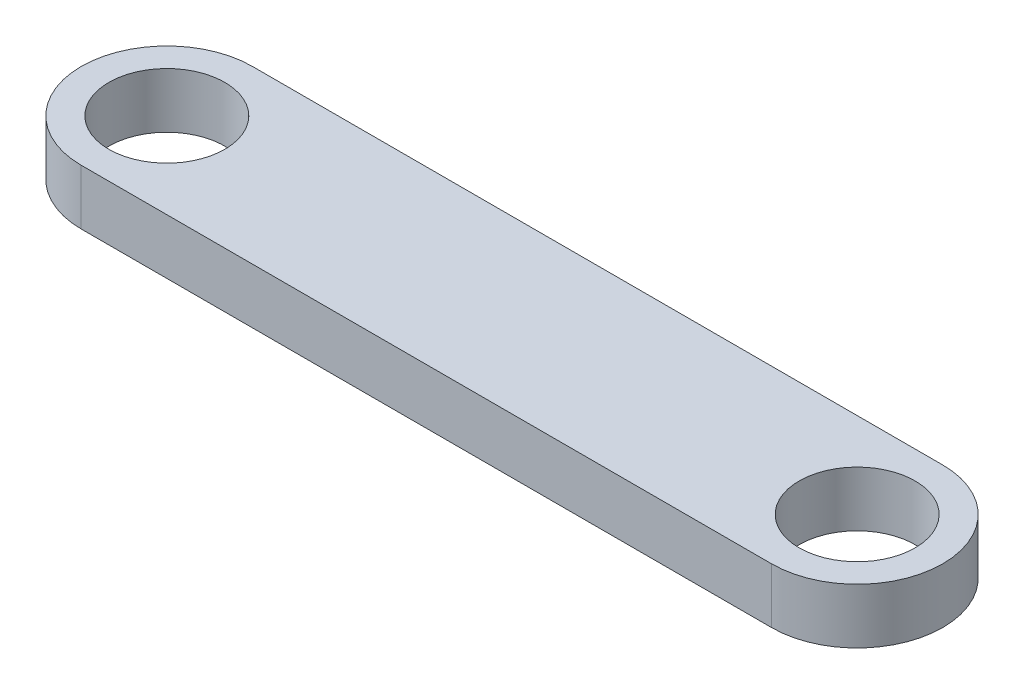
ISO-10303-21;
HEADER;
FILE_DESCRIPTION(('STEP AP214'),'2;1');
FILE_NAME('part.step','',(''),(''),'','','');
FILE_SCHEMA(('AUTOMOTIVE_DESIGN { 1 0 10303 214 1 1 1 1 }'));
ENDSEC;
DATA;
#1=APPLICATION_CONTEXT('core data for automotive mechanical design processes');
#2=APPLICATION_PROTOCOL_DEFINITION('international standard','automotive_design',2000,#1);
#3=PRODUCT_CONTEXT('',#1,'mechanical');
#4=PRODUCT('Part','Part','',(#3));
#5=PRODUCT_RELATED_PRODUCT_CATEGORY('part','',(#4));
#6=PRODUCT_DEFINITION_FORMATION('','',#4);
#7=PRODUCT_DEFINITION_CONTEXT('part definition',#1,'design');
#8=PRODUCT_DEFINITION('design','',#6,#7);
#9=PRODUCT_DEFINITION_SHAPE('','',#8);
#10=(LENGTH_UNIT() NAMED_UNIT(*) SI_UNIT(.MILLI.,.METRE.));
#11=(NAMED_UNIT(*) PLANE_ANGLE_UNIT() SI_UNIT($,.RADIAN.));
#12=(NAMED_UNIT(*) SI_UNIT($,.STERADIAN.) SOLID_ANGLE_UNIT());
#13=UNCERTAINTY_MEASURE_WITH_UNIT(LENGTH_MEASURE(1.E-05),#10,'distance_accuracy_value','');
#14=(GEOMETRIC_REPRESENTATION_CONTEXT(3) GLOBAL_UNCERTAINTY_ASSIGNED_CONTEXT((#13)) GLOBAL_UNIT_ASSIGNED_CONTEXT((#10,
#11,#12)) REPRESENTATION_CONTEXT('',''));
#15=CARTESIAN_POINT('',(0.,0.,0.));
#16=DIRECTION('',(0.,0.,1.));
#17=DIRECTION('',(1.,0.,0.));
#18=AXIS2_PLACEMENT_3D('',#15,#16,#17);
#19=CARTESIAN_POINT('',(-12.5,2.,0.));
#20=DIRECTION('',(0.,-1.,0.));
#21=DIRECTION('',(0.,0.,-1.));
#22=AXIS2_PLACEMENT_3D('',#19,#20,#21);
#23=PLANE('',#22);
#24=CARTESIAN_POINT('',(-12.5,2.,0.));
#25=DIRECTION('',(0.,1.,0.));
#26=DIRECTION('',(0.,0.,-1.));
#27=AXIS2_PLACEMENT_3D('',#24,#25,#26);
#28=CIRCLE('',#27,3.1);
#29=CARTESIAN_POINT('',(-12.5,2.,-3.1));
#30=VERTEX_POINT('',#29);
#31=CARTESIAN_POINT('',(-12.5,2.,3.1));
#32=VERTEX_POINT('',#31);
#33=EDGE_CURVE('E84',#30,#32,#28,.T.);
#34=ORIENTED_EDGE('',*,*,#33,.T.);
#35=DIRECTION('',(1.,0.,0.));
#36=VECTOR('',#35,1.);
#37=CARTESIAN_POINT('',(12.5,2.,3.1));
#38=LINE('',#37,#36);
#39=CARTESIAN_POINT('',(12.5,2.,3.1));
#40=VERTEX_POINT('',#39);
#41=EDGE_CURVE('E79',#32,#40,#38,.T.);
#42=ORIENTED_EDGE('',*,*,#41,.T.);
#43=CARTESIAN_POINT('',(12.5,2.,0.));
#44=DIRECTION('',(0.,1.,0.));
#45=DIRECTION('',(0.,0.,-1.));
#46=AXIS2_PLACEMENT_3D('',#43,#44,#45);
#47=CIRCLE('',#46,3.1);
#48=CARTESIAN_POINT('',(12.5,2.,-3.1));
#49=VERTEX_POINT('',#48);
#50=EDGE_CURVE('E82',#40,#49,#47,.T.);
#51=ORIENTED_EDGE('',*,*,#50,.T.);
#52=DIRECTION('',(-1.,0.,0.));
#53=VECTOR('',#52,1.);
#54=CARTESIAN_POINT('',(-12.5,2.,-3.1));
#55=LINE('',#54,#53);
#56=EDGE_CURVE('E49',#49,#30,#55,.T.);
#57=ORIENTED_EDGE('',*,*,#56,.T.);
#58=EDGE_LOOP('',(#34,#42,#51,#57));
#59=FACE_BOUND('',#58,.T.);
#60=CARTESIAN_POINT('',(-12.5,2.,0.));
#61=DIRECTION('',(0.,1.,0.));
#62=DIRECTION('',(0.,0.,1.));
#63=AXIS2_PLACEMENT_3D('',#60,#61,#62);
#64=CIRCLE('',#63,2.1);
#65=CARTESIAN_POINT('',(-12.5,2.,2.1));
#66=VERTEX_POINT('',#65);
#67=EDGE_CURVE('E99',#66,#66,#64,.T.);
#68=ORIENTED_EDGE('',*,*,#67,.F.);
#69=EDGE_LOOP('',(#68));
#70=FACE_BOUND('',#69,.T.);
#71=CARTESIAN_POINT('',(12.5,2.,0.));
#72=DIRECTION('',(0.,1.,0.));
#73=DIRECTION('',(0.,0.,1.));
#74=AXIS2_PLACEMENT_3D('',#71,#72,#73);
#75=CIRCLE('',#74,2.1);
#76=CARTESIAN_POINT('',(12.5,2.,2.1));
#77=VERTEX_POINT('',#76);
#78=EDGE_CURVE('E114',#77,#77,#75,.T.);
#79=ORIENTED_EDGE('',*,*,#78,.F.);
#80=EDGE_LOOP('',(#79));
#81=FACE_BOUND('',#80,.T.);
#82=ADVANCED_FACE('F32',(#59,#70,#81),#23,.F.);
#83=CARTESIAN_POINT('',(-12.5,0.,0.));
#84=DIRECTION('',(0.,-1.,0.));
#85=DIRECTION('',(0.,0.,-1.));
#86=AXIS2_PLACEMENT_3D('',#83,#84,#85);
#87=PLANE('',#86);
#88=CARTESIAN_POINT('',(-12.5,0.,0.));
#89=DIRECTION('',(0.,1.,0.));
#90=DIRECTION('',(0.,0.,1.));
#91=AXIS2_PLACEMENT_3D('',#88,#89,#90);
#92=CIRCLE('',#91,2.1);
#93=CARTESIAN_POINT('',(-12.5,0.,2.1));
#94=VERTEX_POINT('',#93);
#95=EDGE_CURVE('E111',#94,#94,#92,.T.);
#96=ORIENTED_EDGE('',*,*,#95,.T.);
#97=EDGE_LOOP('',(#96));
#98=FACE_BOUND('',#97,.T.);
#99=CARTESIAN_POINT('',(-12.5,0.,0.));
#100=DIRECTION('',(0.,1.,0.));
#101=DIRECTION('',(0.,0.,-1.));
#102=AXIS2_PLACEMENT_3D('',#99,#100,#101);
#103=CIRCLE('',#102,3.1);
#104=CARTESIAN_POINT('',(-12.5,0.,-3.1));
#105=VERTEX_POINT('',#104);
#106=CARTESIAN_POINT('',(-12.5,0.,3.1));
#107=VERTEX_POINT('',#106);
#108=EDGE_CURVE('E96',#105,#107,#103,.T.);
#109=ORIENTED_EDGE('',*,*,#108,.F.);
#110=DIRECTION('',(-1.,0.,0.));
#111=VECTOR('',#110,1.);
#112=CARTESIAN_POINT('',(-12.5,0.,-3.1));
#113=LINE('',#112,#111);
#114=CARTESIAN_POINT('',(12.5,0.,-3.1));
#115=VERTEX_POINT('',#114);
#116=EDGE_CURVE('E72',#115,#105,#113,.T.);
#117=ORIENTED_EDGE('',*,*,#116,.F.);
#118=CARTESIAN_POINT('',(12.5,0.,0.));
#119=DIRECTION('',(0.,1.,0.));
#120=DIRECTION('',(0.,0.,-1.));
#121=AXIS2_PLACEMENT_3D('',#118,#119,#120);
#122=CIRCLE('',#121,3.1);
#123=CARTESIAN_POINT('',(12.5,0.,3.1));
#124=VERTEX_POINT('',#123);
#125=EDGE_CURVE('E66',#124,#115,#122,.T.);
#126=ORIENTED_EDGE('',*,*,#125,.F.);
#127=DIRECTION('',(1.,0.,0.));
#128=VECTOR('',#127,1.);
#129=CARTESIAN_POINT('',(12.5,0.,3.1));
#130=LINE('',#129,#128);
#131=EDGE_CURVE('E88',#107,#124,#130,.T.);
#132=ORIENTED_EDGE('',*,*,#131,.F.);
#133=EDGE_LOOP('',(#109,#117,#126,#132));
#134=FACE_BOUND('',#133,.T.);
#135=CARTESIAN_POINT('',(12.5,0.,0.));
#136=DIRECTION('',(0.,1.,0.));
#137=DIRECTION('',(0.,0.,1.));
#138=AXIS2_PLACEMENT_3D('',#135,#136,#137);
#139=CIRCLE('',#138,2.1);
#140=CARTESIAN_POINT('',(12.5,0.,2.1));
#141=VERTEX_POINT('',#140);
#142=EDGE_CURVE('E117',#141,#141,#139,.T.);
#143=ORIENTED_EDGE('',*,*,#142,.T.);
#144=EDGE_LOOP('',(#143));
#145=FACE_BOUND('',#144,.T.);
#146=ADVANCED_FACE('F107',(#98,#134,#145),#87,.T.);
#147=CARTESIAN_POINT('',(-12.5,2.,0.));
#148=DIRECTION('',(0.,-1.,0.));
#149=DIRECTION('',(0.,0.,-1.));
#150=AXIS2_PLACEMENT_3D('',#147,#148,#149);
#151=CYLINDRICAL_SURFACE('',#150,3.1);
#152=ORIENTED_EDGE('',*,*,#108,.T.);
#153=DIRECTION('',(0.,-1.,0.));
#154=VECTOR('',#153,1.);
#155=CARTESIAN_POINT('',(-12.5,2.,3.1));
#156=LINE('',#155,#154);
#157=EDGE_CURVE('E11',#32,#107,#156,.T.);
#158=ORIENTED_EDGE('',*,*,#157,.F.);
#159=ORIENTED_EDGE('',*,*,#33,.F.);
#160=DIRECTION('',(0.,-1.,0.));
#161=VECTOR('',#160,1.);
#162=CARTESIAN_POINT('',(-12.5,2.,-3.1));
#163=LINE('',#162,#161);
#164=EDGE_CURVE('E92',#30,#105,#163,.T.);
#165=ORIENTED_EDGE('',*,*,#164,.T.);
#166=EDGE_LOOP('',(#152,#158,#159,#165));
#167=FACE_BOUND('',#166,.T.);
#168=ADVANCED_FACE('F34',(#167),#151,.T.);
#169=CARTESIAN_POINT('',(12.5,2.,3.1));
#170=DIRECTION('',(0.,0.,-1.));
#171=DIRECTION('',(-1.,0.,0.));
#172=AXIS2_PLACEMENT_3D('',#169,#170,#171);
#173=PLANE('',#172);
#174=ORIENTED_EDGE('',*,*,#131,.T.);
#175=DIRECTION('',(0.,-1.,0.));
#176=VECTOR('',#175,1.);
#177=CARTESIAN_POINT('',(12.5,2.,3.1));
#178=LINE('',#177,#176);
#179=EDGE_CURVE('E41',#40,#124,#178,.T.);
#180=ORIENTED_EDGE('',*,*,#179,.F.);
#181=ORIENTED_EDGE('',*,*,#41,.F.);
#182=ORIENTED_EDGE('',*,*,#157,.T.);
#183=EDGE_LOOP('',(#174,#180,#181,#182));
#184=FACE_BOUND('',#183,.T.);
#185=ADVANCED_FACE('F87',(#184),#173,.F.);
#186=CARTESIAN_POINT('',(12.5,2.,0.));
#187=DIRECTION('',(0.,-1.,0.));
#188=DIRECTION('',(0.,0.,-1.));
#189=AXIS2_PLACEMENT_3D('',#186,#187,#188);
#190=CYLINDRICAL_SURFACE('',#189,3.1);
#191=ORIENTED_EDGE('',*,*,#125,.T.);
#192=DIRECTION('',(0.,-1.,0.));
#193=VECTOR('',#192,1.);
#194=CARTESIAN_POINT('',(12.5,2.,-3.1));
#195=LINE('',#194,#193);
#196=EDGE_CURVE('E89',#49,#115,#195,.T.);
#197=ORIENTED_EDGE('',*,*,#196,.F.);
#198=ORIENTED_EDGE('',*,*,#50,.F.);
#199=ORIENTED_EDGE('',*,*,#179,.T.);
#200=EDGE_LOOP('',(#191,#197,#198,#199));
#201=FACE_BOUND('',#200,.T.);
#202=ADVANCED_FACE('F90',(#201),#190,.T.);
#203=CARTESIAN_POINT('',(-12.5,2.,-3.1));
#204=DIRECTION('',(0.,0.,1.));
#205=DIRECTION('',(1.,0.,0.));
#206=AXIS2_PLACEMENT_3D('',#203,#204,#205);
#207=PLANE('',#206);
#208=ORIENTED_EDGE('',*,*,#116,.T.);
#209=ORIENTED_EDGE('',*,*,#164,.F.);
#210=ORIENTED_EDGE('',*,*,#56,.F.);
#211=ORIENTED_EDGE('',*,*,#196,.T.);
#212=EDGE_LOOP('',(#208,#209,#210,#211));
#213=FACE_BOUND('',#212,.T.);
#214=ADVANCED_FACE('F104',(#213),#207,.F.);
#215=CARTESIAN_POINT('',(-12.5,2.,0.));
#216=DIRECTION('',(0.,-1.,0.));
#217=DIRECTION('',(0.,0.,-1.));
#218=AXIS2_PLACEMENT_3D('',#215,#216,#217);
#219=CYLINDRICAL_SURFACE('',#218,2.1);
#220=ORIENTED_EDGE('',*,*,#67,.T.);
#221=EDGE_LOOP('',(#220));
#222=FACE_BOUND('',#221,.T.);
#223=ORIENTED_EDGE('',*,*,#95,.F.);
#224=EDGE_LOOP('',(#223));
#225=FACE_BOUND('',#224,.T.);
#226=ADVANCED_FACE('F134',(#222,#225),#219,.F.);
#227=CARTESIAN_POINT('',(12.5,2.,0.));
#228=DIRECTION('',(0.,-1.,0.));
#229=DIRECTION('',(0.,0.,-1.));
#230=AXIS2_PLACEMENT_3D('',#227,#228,#229);
#231=CYLINDRICAL_SURFACE('',#230,2.1);
#232=ORIENTED_EDGE('',*,*,#78,.T.);
#233=EDGE_LOOP('',(#232));
#234=FACE_BOUND('',#233,.T.);
#235=ORIENTED_EDGE('',*,*,#142,.F.);
#236=EDGE_LOOP('',(#235));
#237=FACE_BOUND('',#236,.T.);
#238=ADVANCED_FACE('F123',(#234,#237),#231,.F.);
#239=CLOSED_SHELL('',(#82,#146,#168,#185,#202,#214,#226,#238));
#240=MANIFOLD_SOLID_BREP('B2',#239);
#241=ADVANCED_BREP_SHAPE_REPRESENTATION('',(#18,#240),#14);
#242=SHAPE_DEFINITION_REPRESENTATION(#9,#241);
ENDSEC;
END-ISO-10303-21;
